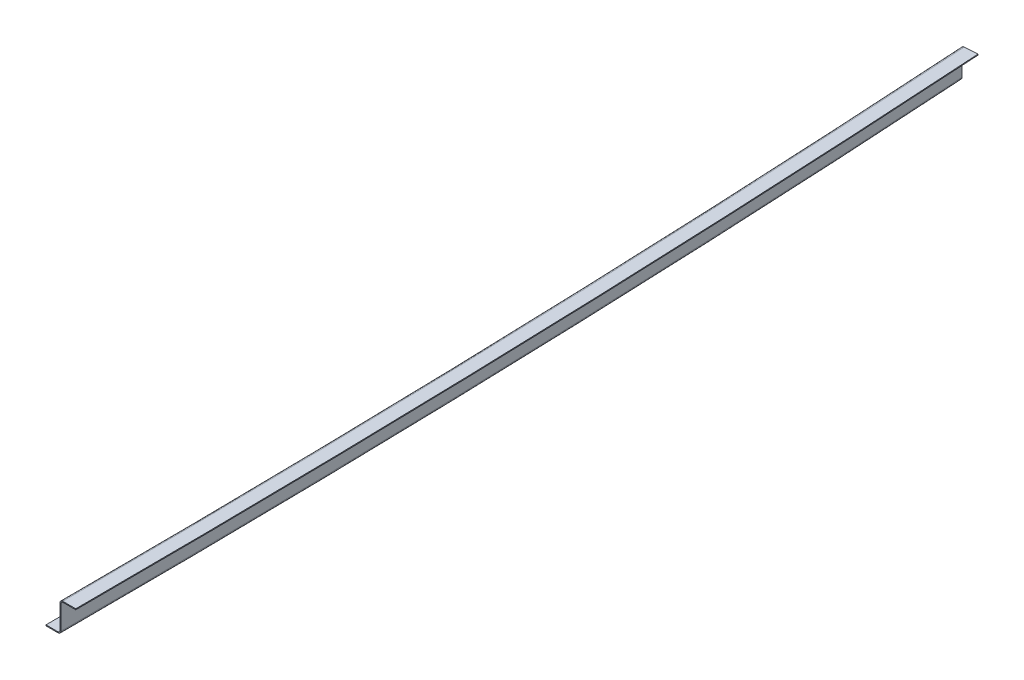
ISO-10303-21;
HEADER;
FILE_DESCRIPTION(('STEP AP214'),'2;1');
FILE_NAME('part.step','',(''),(''),'','','');
FILE_SCHEMA(('AUTOMOTIVE_DESIGN { 1 0 10303 214 1 1 1 1 }'));
ENDSEC;
DATA;
#1=APPLICATION_CONTEXT('core data for automotive mechanical design processes');
#2=APPLICATION_PROTOCOL_DEFINITION('international standard','automotive_design',2000,#1);
#3=PRODUCT_CONTEXT('',#1,'mechanical');
#4=PRODUCT('Part','Part','',(#3));
#5=PRODUCT_RELATED_PRODUCT_CATEGORY('part','',(#4));
#6=PRODUCT_DEFINITION_FORMATION('','',#4);
#7=PRODUCT_DEFINITION_CONTEXT('part definition',#1,'design');
#8=PRODUCT_DEFINITION('design','',#6,#7);
#9=PRODUCT_DEFINITION_SHAPE('','',#8);
#10=(LENGTH_UNIT() NAMED_UNIT(*) SI_UNIT(.MILLI.,.METRE.));
#11=(NAMED_UNIT(*) PLANE_ANGLE_UNIT() SI_UNIT($,.RADIAN.));
#12=(NAMED_UNIT(*) SI_UNIT($,.STERADIAN.) SOLID_ANGLE_UNIT());
#13=UNCERTAINTY_MEASURE_WITH_UNIT(LENGTH_MEASURE(1.E-05),#10,'distance_accuracy_value','');
#14=(GEOMETRIC_REPRESENTATION_CONTEXT(3) GLOBAL_UNCERTAINTY_ASSIGNED_CONTEXT((#13)) GLOBAL_UNIT_ASSIGNED_CONTEXT((#10,
#11,#12)) REPRESENTATION_CONTEXT('',''));
#15=CARTESIAN_POINT('',(0.,0.,0.));
#16=DIRECTION('',(0.,0.,1.));
#17=DIRECTION('',(1.,0.,0.));
#18=AXIS2_PLACEMENT_3D('',#15,#16,#17);
#19=CARTESIAN_POINT('',(-29.3827632036244,29.,-1000.12539184953));
#20=DIRECTION('',(-0.0626959247648903,0.,-0.998032675325751));
#21=DIRECTION('',(-0.998032675325751,0.,0.0626959247648903));
#22=AXIS2_PLACEMENT_3D('',#19,#20,#21);
#23=PLANE('',#22);
#24=DIRECTION('',(0.,1.,0.));
#25=VECTOR('',#24,1.);
#26=CARTESIAN_POINT('',(-29.3827632036248,31.,-1000.12539184953));
#27=LINE('',#26,#25);
#28=CARTESIAN_POINT('',(-29.3827632036248,31.,-1000.12539184953));
#29=VERTEX_POINT('',#28);
#30=CARTESIAN_POINT('',(-29.3827632036248,32.,-1000.12539184953));
#31=VERTEX_POINT('',#30);
#32=EDGE_CURVE('E11',#29,#31,#27,.T.);
#33=ORIENTED_EDGE('',*,*,#32,.F.);
#34=CARTESIAN_POINT('',(-29.3827632036244,29.,-1000.12539184953));
#35=DIRECTION('',(0.0626959247648903,0.,0.998032675325751));
#36=DIRECTION('',(0.998032675325751,0.,-0.0626959247648903));
#37=AXIS2_PLACEMENT_3D('',#34,#35,#36);
#38=CIRCLE('',#37,2.);
#39=CARTESIAN_POINT('',(-31.378828554276,29.,-1000.));
#40=VERTEX_POINT('',#39);
#41=EDGE_CURVE('E156',#40,#29,#38,.F.);
#42=ORIENTED_EDGE('',*,*,#41,.F.);
#43=DIRECTION('',(-0.998032675325751,0.,0.0626959247648904));
#44=VECTOR('',#43,1.);
#45=CARTESIAN_POINT('',(-31.378828554276,29.,-1000.));
#46=LINE('',#45,#44);
#47=CARTESIAN_POINT('',(-32.3768612296025,29.,-999.937304075236));
#48=VERTEX_POINT('',#47);
#49=EDGE_CURVE('E45',#40,#48,#46,.T.);
#50=ORIENTED_EDGE('',*,*,#49,.T.);
#51=CARTESIAN_POINT('',(-29.3827632036248,29.,-1000.12539184953));
#52=DIRECTION('',(0.0626959247648905,0.,0.998032675325751));
#53=DIRECTION('',(0.998032675325751,0.,-0.0626959247648905));
#54=AXIS2_PLACEMENT_3D('',#51,#52,#53);
#55=CIRCLE('',#54,3.);
#56=EDGE_CURVE('E153',#48,#31,#55,.F.);
#57=ORIENTED_EDGE('',*,*,#56,.T.);
#58=EDGE_LOOP('',(#33,#42,#50,#57));
#59=FACE_BOUND('',#58,.T.);
#60=ADVANCED_FACE('F35',(#59),#23,.T.);
#61=CARTESIAN_POINT('',(-31.3788285542759,16.,-1000.));
#62=DIRECTION('',(-0.0626959247648904,0.,-0.998032675325751));
#63=DIRECTION('',(0.,1.,0.));
#64=AXIS2_PLACEMENT_3D('',#61,#62,#63);
#65=PLANE('',#64);
#66=ORIENTED_EDGE('',*,*,#49,.F.);
#67=DIRECTION('',(0.,1.,0.));
#68=VECTOR('',#67,1.);
#69=CARTESIAN_POINT('',(-31.3788285542759,0.,-1000.));
#70=LINE('',#69,#68);
#71=CARTESIAN_POINT('',(-31.378828554276,3.,-1000.));
#72=VERTEX_POINT('',#71);
#73=EDGE_CURVE('E232',#72,#40,#70,.T.);
#74=ORIENTED_EDGE('',*,*,#73,.F.);
#75=DIRECTION('',(-0.998032675325751,0.,0.062695924764886));
#76=VECTOR('',#75,1.);
#77=CARTESIAN_POINT('',(-31.378828554276,3.,-1000.));
#78=LINE('',#77,#76);
#79=CARTESIAN_POINT('',(-32.3768612296025,3.,-999.937304075236));
#80=VERTEX_POINT('',#79);
#81=EDGE_CURVE('E145',#72,#80,#78,.T.);
#82=ORIENTED_EDGE('',*,*,#81,.T.);
#83=DIRECTION('',(0.,1.,0.));
#84=VECTOR('',#83,1.);
#85=CARTESIAN_POINT('',(-32.3768612296025,0.,-999.937304075236));
#86=LINE('',#85,#84);
#87=EDGE_CURVE('E173',#80,#48,#86,.T.);
#88=ORIENTED_EDGE('',*,*,#87,.T.);
#89=EDGE_LOOP('',(#66,#74,#82,#88));
#90=FACE_BOUND('',#89,.T.);
#91=ADVANCED_FACE('F174',(#90),#65,.T.);
#92=CARTESIAN_POINT('',(-34.3729265802532,3.,-999.811912225706));
#93=DIRECTION('',(0.0626959247648903,0.,0.998032675325751));
#94=DIRECTION('',(0.998032675325751,0.,-0.0626959247648903));
#95=AXIS2_PLACEMENT_3D('',#92,#93,#94);
#96=PLANE('',#95);
#97=ORIENTED_EDGE('',*,*,#81,.F.);
#98=CARTESIAN_POINT('',(-34.3729265802532,3.,-999.811912225706));
#99=DIRECTION('',(-0.0626959247648903,0.,-0.998032675325751));
#100=DIRECTION('',(-0.998032675325751,0.,0.0626959247648903));
#101=AXIS2_PLACEMENT_3D('',#98,#99,#100);
#102=CIRCLE('',#101,3.);
#103=CARTESIAN_POINT('',(-34.3729265802537,0.,-999.811912225706));
#104=VERTEX_POINT('',#103);
#105=EDGE_CURVE('E221',#104,#72,#102,.F.);
#106=ORIENTED_EDGE('',*,*,#105,.F.);
#107=DIRECTION('',(0.,1.,0.));
#108=VECTOR('',#107,1.);
#109=CARTESIAN_POINT('',(-34.3729265802537,0.,-999.811912225706));
#110=LINE('',#109,#108);
#111=CARTESIAN_POINT('',(-34.3729265802519,1.,-999.811912225706));
#112=VERTEX_POINT('',#111);
#113=EDGE_CURVE('E142',#104,#112,#110,.T.);
#114=ORIENTED_EDGE('',*,*,#113,.T.);
#115=CARTESIAN_POINT('',(-34.3729265802537,3.,-999.811912225706));
#116=DIRECTION('',(0.0626959247648905,0.,0.998032675325751));
#117=DIRECTION('',(0.998032675325751,0.,-0.0626959247648905));
#118=AXIS2_PLACEMENT_3D('',#115,#116,#117);
#119=CIRCLE('',#118,2.);
#120=EDGE_CURVE('E190',#112,#80,#119,.T.);
#121=ORIENTED_EDGE('',*,*,#120,.T.);
#122=EDGE_LOOP('',(#97,#106,#114,#121));
#123=FACE_BOUND('',#122,.T.);
#124=ADVANCED_FACE('F264',(#123),#96,.F.);
#125=CARTESIAN_POINT('',(-31.3788285542759,0.,-1000.));
#126=DIRECTION('',(0.0626959247648903,0.,0.998032675325751));
#127=DIRECTION('',(0.998032675325751,0.,-0.0626959247648903));
#128=AXIS2_PLACEMENT_3D('',#125,#126,#127);
#129=PLANE('',#128);
#130=ORIENTED_EDGE('',*,*,#113,.F.);
#131=DIRECTION('',(0.998032675325751,0.,-0.0626959247648903));
#132=VECTOR('',#131,1.);
#133=CARTESIAN_POINT('',(-31.3788285542759,0.,-1000.));
#134=LINE('',#133,#132);
#135=CARTESIAN_POINT('',(-47.3473513594893,0.,-998.996865203762));
#136=VERTEX_POINT('',#135);
#137=EDGE_CURVE('E215',#136,#104,#134,.T.);
#138=ORIENTED_EDGE('',*,*,#137,.F.);
#139=DIRECTION('',(0.,1.,0.));
#140=VECTOR('',#139,1.);
#141=CARTESIAN_POINT('',(-47.3473513594893,0.,-998.996865203762));
#142=LINE('',#141,#140);
#143=CARTESIAN_POINT('',(-47.3473513594893,0.999999999999999,-998.996865203762));
#144=VERTEX_POINT('',#143);
#145=EDGE_CURVE('E139',#136,#144,#142,.T.);
#146=ORIENTED_EDGE('',*,*,#145,.T.);
#147=DIRECTION('',(0.998032675325751,0.,-0.0626959247648903));
#148=VECTOR('',#147,1.);
#149=CARTESIAN_POINT('',(-31.3788285542759,1.,-1000.));
#150=LINE('',#149,#148);
#151=EDGE_CURVE('E194',#144,#112,#150,.T.);
#152=ORIENTED_EDGE('',*,*,#151,.T.);
#153=EDGE_LOOP('',(#130,#138,#146,#152));
#154=FACE_BOUND('',#153,.T.);
#155=ADVANCED_FACE('F271',(#154),#129,.F.);
#156=CARTESIAN_POINT('',(-15950.,0.,1.95331164464003E-12));
#157=DIRECTION('',(0.,1.,0.));
#158=DIRECTION('',(0.,0.,1.));
#159=AXIS2_PLACEMENT_3D('',#156,#157,#158);
#160=CYLINDRICAL_SURFACE('',#159,15934.);
#161=ORIENTED_EDGE('',*,*,#145,.F.);
#162=CARTESIAN_POINT('',(-15950.,0.,1.95331164464003E-12));
#163=DIRECTION('',(0.,1.,0.));
#164=DIRECTION('',(1.,0.,0.));
#165=AXIS2_PLACEMENT_3D('',#162,#163,#164);
#166=CIRCLE('',#165,15934.);
#167=CARTESIAN_POINT('',(-16.,0.,0.));
#168=VERTEX_POINT('',#167);
#169=EDGE_CURVE('E111',#168,#136,#166,.T.);
#170=ORIENTED_EDGE('',*,*,#169,.F.);
#171=DIRECTION('',(0.,1.,0.));
#172=VECTOR('',#171,1.);
#173=CARTESIAN_POINT('',(-16.,0.,0.));
#174=LINE('',#173,#172);
#175=CARTESIAN_POINT('',(-16.,0.999999999999999,0.));
#176=VERTEX_POINT('',#175);
#177=EDGE_CURVE('E136',#168,#176,#174,.T.);
#178=ORIENTED_EDGE('',*,*,#177,.T.);
#179=CARTESIAN_POINT('',(-15950.,0.999999999999998,1.95331164464003E-12));
#180=DIRECTION('',(0.,1.,0.));
#181=DIRECTION('',(0.,0.,1.));
#182=AXIS2_PLACEMENT_3D('',#179,#180,#181);
#183=CIRCLE('',#182,15934.);
#184=EDGE_CURVE('E199',#176,#144,#183,.T.);
#185=ORIENTED_EDGE('',*,*,#184,.T.);
#186=EDGE_LOOP('',(#161,#170,#178,#185));
#187=FACE_BOUND('',#186,.T.);
#188=ADVANCED_FACE('F296',(#187),#160,.F.);
#189=CARTESIAN_POINT('',(0.,0.,0.));
#190=DIRECTION('',(0.,0.,1.));
#191=DIRECTION('',(1.,0.,0.));
#192=AXIS2_PLACEMENT_3D('',#189,#190,#191);
#193=PLANE('',#192);
#194=ORIENTED_EDGE('',*,*,#177,.F.);
#195=DIRECTION('',(1.,0.,0.));
#196=VECTOR('',#195,1.);
#197=CARTESIAN_POINT('',(0.,0.,0.));
#198=LINE('',#197,#196);
#199=CARTESIAN_POINT('',(-3.00000000000011,0.,0.));
#200=VERTEX_POINT('',#199);
#201=EDGE_CURVE('E211',#168,#200,#198,.T.);
#202=ORIENTED_EDGE('',*,*,#201,.T.);
#203=DIRECTION('',(0.,1.,0.));
#204=VECTOR('',#203,1.);
#205=CARTESIAN_POINT('',(-3.00000000000011,0.,0.));
#206=LINE('',#205,#204);
#207=CARTESIAN_POINT('',(-3.00000000000011,0.999999999999999,0.));
#208=VERTEX_POINT('',#207);
#209=EDGE_CURVE('E133',#200,#208,#206,.T.);
#210=ORIENTED_EDGE('',*,*,#209,.T.);
#211=DIRECTION('',(1.,0.,0.));
#212=VECTOR('',#211,1.);
#213=CARTESIAN_POINT('',(0.,0.999999999999999,0.));
#214=LINE('',#213,#212);
#215=EDGE_CURVE('E118',#176,#208,#214,.T.);
#216=ORIENTED_EDGE('',*,*,#215,.F.);
#217=EDGE_LOOP('',(#194,#202,#210,#216));
#218=FACE_BOUND('',#217,.T.);
#219=ADVANCED_FACE('F298',(#218),#193,.T.);
#220=CARTESIAN_POINT('',(-3.,3.,0.));
#221=DIRECTION('',(0.,0.,1.));
#222=DIRECTION('',(1.,0.,0.));
#223=AXIS2_PLACEMENT_3D('',#220,#221,#222);
#224=PLANE('',#223);
#225=ORIENTED_EDGE('',*,*,#209,.F.);
#226=CARTESIAN_POINT('',(-3.,3.,0.));
#227=DIRECTION('',(0.,0.,-1.));
#228=DIRECTION('',(-1.,0.,0.));
#229=AXIS2_PLACEMENT_3D('',#226,#227,#228);
#230=CIRCLE('',#229,3.);
#231=CARTESIAN_POINT('',(0.,3.,0.));
#232=VERTEX_POINT('',#231);
#233=EDGE_CURVE('E214',#200,#232,#230,.F.);
#234=ORIENTED_EDGE('',*,*,#233,.T.);
#235=DIRECTION('',(-1.,0.,0.));
#236=VECTOR('',#235,1.);
#237=CARTESIAN_POINT('',(0.,3.,0.));
#238=LINE('',#237,#236);
#239=CARTESIAN_POINT('',(-0.999999999999446,3.,-6.11483169329239E-13));
#240=VERTEX_POINT('',#239);
#241=EDGE_CURVE('E130',#232,#240,#238,.T.);
#242=ORIENTED_EDGE('',*,*,#241,.T.);
#243=CARTESIAN_POINT('',(-3.00000000000011,3.,-6.11161544799304E-13));
#244=DIRECTION('',(0.,0.,1.));
#245=DIRECTION('',(1.,0.,0.));
#246=AXIS2_PLACEMENT_3D('',#243,#244,#245);
#247=CIRCLE('',#246,2.);
#248=EDGE_CURVE('E121',#208,#240,#247,.T.);
#249=ORIENTED_EDGE('',*,*,#248,.F.);
#250=EDGE_LOOP('',(#225,#234,#242,#249));
#251=FACE_BOUND('',#250,.T.);
#252=ADVANCED_FACE('F278',(#251),#224,.T.);
#253=CARTESIAN_POINT('',(0.,16.,0.));
#254=DIRECTION('',(0.,0.,-1.));
#255=DIRECTION('',(0.,1.,0.));
#256=AXIS2_PLACEMENT_3D('',#253,#254,#255);
#257=PLANE('',#256);
#258=ORIENTED_EDGE('',*,*,#241,.F.);
#259=DIRECTION('',(0.,1.,0.));
#260=VECTOR('',#259,1.);
#261=CARTESIAN_POINT('',(0.,0.,0.));
#262=LINE('',#261,#260);
#263=CARTESIAN_POINT('',(0.,29.,0.));
#264=VERTEX_POINT('',#263);
#265=EDGE_CURVE('E226',#232,#264,#262,.T.);
#266=ORIENTED_EDGE('',*,*,#265,.T.);
#267=DIRECTION('',(-1.,0.,0.));
#268=VECTOR('',#267,1.);
#269=CARTESIAN_POINT('',(0.,29.,0.));
#270=LINE('',#269,#268);
#271=CARTESIAN_POINT('',(-0.999999999999446,29.,-6.11483169329239E-13));
#272=VERTEX_POINT('',#271);
#273=EDGE_CURVE('E127',#264,#272,#270,.T.);
#274=ORIENTED_EDGE('',*,*,#273,.T.);
#275=DIRECTION('',(0.,1.,0.));
#276=VECTOR('',#275,1.);
#277=CARTESIAN_POINT('',(-0.999999999999446,0.,-6.11483169329239E-13));
#278=LINE('',#277,#276);
#279=EDGE_CURVE('E183',#240,#272,#278,.T.);
#280=ORIENTED_EDGE('',*,*,#279,.F.);
#281=EDGE_LOOP('',(#258,#266,#274,#280));
#282=FACE_BOUND('',#281,.T.);
#283=ADVANCED_FACE('F281',(#282),#257,.F.);
#284=CARTESIAN_POINT('',(2.,29.,0.));
#285=DIRECTION('',(0.,0.,-1.));
#286=DIRECTION('',(-1.,0.,0.));
#287=AXIS2_PLACEMENT_3D('',#284,#285,#286);
#288=PLANE('',#287);
#289=ORIENTED_EDGE('',*,*,#273,.F.);
#290=CARTESIAN_POINT('',(2.,29.,0.));
#291=DIRECTION('',(0.,0.,1.));
#292=DIRECTION('',(1.,0.,0.));
#293=AXIS2_PLACEMENT_3D('',#290,#291,#292);
#294=CIRCLE('',#293,2.);
#295=CARTESIAN_POINT('',(2.00000000000067,31.,0.));
#296=VERTEX_POINT('',#295);
#297=EDGE_CURVE('E112',#264,#296,#294,.F.);
#298=ORIENTED_EDGE('',*,*,#297,.T.);
#299=DIRECTION('',(0.,1.,0.));
#300=VECTOR('',#299,1.);
#301=CARTESIAN_POINT('',(2.00000000000067,31.,0.));
#302=LINE('',#301,#300);
#303=CARTESIAN_POINT('',(2.00000000000067,32.,-6.11965606124142E-13));
#304=VERTEX_POINT('',#303);
#305=EDGE_CURVE('E101',#296,#304,#302,.T.);
#306=ORIENTED_EDGE('',*,*,#305,.T.);
#307=CARTESIAN_POINT('',(2.00000000000067,29.,-6.11965606124142E-13));
#308=DIRECTION('',(0.,0.,1.));
#309=DIRECTION('',(1.,0.,0.));
#310=AXIS2_PLACEMENT_3D('',#307,#308,#309);
#311=CIRCLE('',#310,3.);
#312=EDGE_CURVE('E200',#272,#304,#311,.F.);
#313=ORIENTED_EDGE('',*,*,#312,.F.);
#314=EDGE_LOOP('',(#289,#298,#306,#313));
#315=FACE_BOUND('',#314,.T.);
#316=ADVANCED_FACE('F287',(#315),#288,.F.);
#317=CARTESIAN_POINT('',(0.,31.,0.));
#318=DIRECTION('',(0.,0.,1.));
#319=DIRECTION('',(1.,0.,0.));
#320=AXIS2_PLACEMENT_3D('',#317,#318,#319);
#321=PLANE('',#320);
#322=ORIENTED_EDGE('',*,*,#305,.F.);
#323=DIRECTION('',(1.,0.,0.));
#324=VECTOR('',#323,1.);
#325=CARTESIAN_POINT('',(0.,31.,0.));
#326=LINE('',#325,#324);
#327=CARTESIAN_POINT('',(16.,31.,0.));
#328=VERTEX_POINT('',#327);
#329=EDGE_CURVE('E104',#296,#328,#326,.T.);
#330=ORIENTED_EDGE('',*,*,#329,.T.);
#331=DIRECTION('',(0.,1.,0.));
#332=VECTOR('',#331,1.);
#333=CARTESIAN_POINT('',(16.,31.,0.));
#334=LINE('',#333,#332);
#335=CARTESIAN_POINT('',(16.,32.,0.));
#336=VERTEX_POINT('',#335);
#337=EDGE_CURVE('E90',#328,#336,#334,.T.);
#338=ORIENTED_EDGE('',*,*,#337,.T.);
#339=DIRECTION('',(1.,0.,0.));
#340=VECTOR('',#339,1.);
#341=CARTESIAN_POINT('',(0.,32.,0.));
#342=LINE('',#341,#340);
#343=EDGE_CURVE('E197',#304,#336,#342,.T.);
#344=ORIENTED_EDGE('',*,*,#343,.F.);
#345=EDGE_LOOP('',(#322,#330,#338,#344));
#346=FACE_BOUND('',#345,.T.);
#347=ADVANCED_FACE('F105',(#346),#321,.T.);
#348=CARTESIAN_POINT('',(-15950.,31.,1.95331164464003E-12));
#349=DIRECTION('',(0.,1.,0.));
#350=DIRECTION('',(0.,0.,1.));
#351=AXIS2_PLACEMENT_3D('',#348,#349,#350);
#352=CYLINDRICAL_SURFACE('',#351,15966.);
#353=ORIENTED_EDGE('',*,*,#337,.F.);
#354=CARTESIAN_POINT('',(-15950.,31.,1.95331164464003E-12));
#355=DIRECTION('',(0.,1.,0.));
#356=DIRECTION('',(1.,0.,0.));
#357=AXIS2_PLACEMENT_3D('',#354,#355,#356);
#358=CIRCLE('',#357,15966.);
#359=CARTESIAN_POINT('',(-15.4103057490644,31.,-1001.00313479624));
#360=VERTEX_POINT('',#359);
#361=EDGE_CURVE('E94',#328,#360,#358,.T.);
#362=ORIENTED_EDGE('',*,*,#361,.T.);
#363=DIRECTION('',(0.,1.,0.));
#364=VECTOR('',#363,1.);
#365=CARTESIAN_POINT('',(-15.4103057490644,31.,-1001.00313479624));
#366=LINE('',#365,#364);
#367=CARTESIAN_POINT('',(-15.4103057490644,32.,-1001.00313479624));
#368=VERTEX_POINT('',#367);
#369=EDGE_CURVE('E39',#360,#368,#366,.T.);
#370=ORIENTED_EDGE('',*,*,#369,.T.);
#371=CARTESIAN_POINT('',(-15950.,32.,1.95331164464003E-12));
#372=DIRECTION('',(0.,1.,0.));
#373=DIRECTION('',(0.,0.,1.));
#374=AXIS2_PLACEMENT_3D('',#371,#372,#373);
#375=CIRCLE('',#374,15966.);
#376=EDGE_CURVE('E97',#336,#368,#375,.T.);
#377=ORIENTED_EDGE('',*,*,#376,.F.);
#378=EDGE_LOOP('',(#353,#362,#370,#377));
#379=FACE_BOUND('',#378,.T.);
#380=ADVANCED_FACE('F92',(#379),#352,.T.);
#381=CARTESIAN_POINT('',(-31.3788285542759,31.,-1000.));
#382=DIRECTION('',(0.0626959247648903,0.,0.998032675325751));
#383=DIRECTION('',(0.998032675325751,0.,-0.0626959247648903));
#384=AXIS2_PLACEMENT_3D('',#381,#382,#383);
#385=PLANE('',#384);
#386=DIRECTION('',(0.998032675325751,0.,-0.0626959247648903));
#387=VECTOR('',#386,1.);
#388=CARTESIAN_POINT('',(-31.3788285542759,31.,-1000.));
#389=LINE('',#388,#387);
#390=EDGE_CURVE('E117',#29,#360,#389,.T.);
#391=ORIENTED_EDGE('',*,*,#390,.F.);
#392=ORIENTED_EDGE('',*,*,#32,.T.);
#393=DIRECTION('',(0.998032675325751,0.,-0.0626959247648903));
#394=VECTOR('',#393,1.);
#395=CARTESIAN_POINT('',(-31.3788285542759,32.,-1000.));
#396=LINE('',#395,#394);
#397=EDGE_CURVE('E196',#31,#368,#396,.T.);
#398=ORIENTED_EDGE('',*,*,#397,.T.);
#399=ORIENTED_EDGE('',*,*,#369,.F.);
#400=EDGE_LOOP('',(#391,#392,#398,#399));
#401=FACE_BOUND('',#400,.T.);
#402=ADVANCED_FACE('F37',(#401),#385,.F.);
#403=CARTESIAN_POINT('',(0.,32.,0.));
#404=DIRECTION('',(0.,1.,0.));
#405=DIRECTION('',(0.,0.,1.));
#406=AXIS2_PLACEMENT_3D('',#403,#404,#405);
#407=PLANE('',#406);
#408=ORIENTED_EDGE('',*,*,#376,.T.);
#409=ORIENTED_EDGE('',*,*,#397,.F.);
#410=CARTESIAN_POINT('',(-15950.,32.,1.95331164464003E-12));
#411=DIRECTION('',(0.,1.,0.));
#412=DIRECTION('',(0.,0.,1.));
#413=AXIS2_PLACEMENT_3D('',#410,#411,#412);
#414=CIRCLE('',#413,15952.);
#415=EDGE_CURVE('E170',#304,#31,#414,.T.);
#416=ORIENTED_EDGE('',*,*,#415,.F.);
#417=ORIENTED_EDGE('',*,*,#343,.T.);
#418=EDGE_LOOP('',(#408,#409,#416,#417));
#419=FACE_BOUND('',#418,.T.);
#420=ADVANCED_FACE('F388',(#419),#407,.T.);
#421=CARTESIAN_POINT('',(-15950.,29.,1.95331164464003E-12));
#422=DIRECTION('',(0.,1.,0.));
#423=DIRECTION('',(0.,0.,1.));
#424=AXIS2_PLACEMENT_3D('',#421,#422,#423);
#425=TOROIDAL_SURFACE('',#424,15952.,3.);
#426=ORIENTED_EDGE('',*,*,#415,.T.);
#427=ORIENTED_EDGE('',*,*,#56,.F.);
#428=CARTESIAN_POINT('',(-15950.,29.,1.95331164464003E-12));
#429=DIRECTION('',(0.,1.,0.));
#430=DIRECTION('',(0.,0.,1.));
#431=AXIS2_PLACEMENT_3D('',#428,#429,#430);
#432=CIRCLE('',#431,15949.);
#433=EDGE_CURVE('E168',#272,#48,#432,.T.);
#434=ORIENTED_EDGE('',*,*,#433,.F.);
#435=ORIENTED_EDGE('',*,*,#312,.T.);
#436=EDGE_LOOP('',(#426,#427,#434,#435));
#437=FACE_BOUND('',#436,.T.);
#438=ADVANCED_FACE('F164',(#437),#425,.T.);
#439=CARTESIAN_POINT('',(-15950.,0.,1.95331164464003E-12));
#440=DIRECTION('',(0.,1.,0.));
#441=DIRECTION('',(0.,0.,1.));
#442=AXIS2_PLACEMENT_3D('',#439,#440,#441);
#443=CYLINDRICAL_SURFACE('',#442,15949.);
#444=ORIENTED_EDGE('',*,*,#433,.T.);
#445=ORIENTED_EDGE('',*,*,#87,.F.);
#446=CARTESIAN_POINT('',(-15950.,3.,1.95331164464003E-12));
#447=DIRECTION('',(0.,1.,0.));
#448=DIRECTION('',(0.,0.,1.));
#449=AXIS2_PLACEMENT_3D('',#446,#447,#448);
#450=CIRCLE('',#449,15949.);
#451=EDGE_CURVE('E178',#240,#80,#450,.T.);
#452=ORIENTED_EDGE('',*,*,#451,.F.);
#453=ORIENTED_EDGE('',*,*,#279,.T.);
#454=EDGE_LOOP('',(#444,#445,#452,#453));
#455=FACE_BOUND('',#454,.T.);
#456=ADVANCED_FACE('F181',(#455),#443,.F.);
#457=CARTESIAN_POINT('',(-15950.,3.,1.95331164464003E-12));
#458=DIRECTION('',(0.,1.,0.));
#459=DIRECTION('',(0.,0.,1.));
#460=AXIS2_PLACEMENT_3D('',#457,#458,#459);
#461=TOROIDAL_SURFACE('',#460,15947.,2.);
#462=ORIENTED_EDGE('',*,*,#451,.T.);
#463=ORIENTED_EDGE('',*,*,#120,.F.);
#464=CARTESIAN_POINT('',(-15950.,1.,1.95331164464003E-12));
#465=DIRECTION('',(0.,1.,0.));
#466=DIRECTION('',(0.,0.,1.));
#467=AXIS2_PLACEMENT_3D('',#464,#465,#466);
#468=CIRCLE('',#467,15947.);
#469=EDGE_CURVE('E191',#208,#112,#468,.T.);
#470=ORIENTED_EDGE('',*,*,#469,.F.);
#471=ORIENTED_EDGE('',*,*,#248,.T.);
#472=EDGE_LOOP('',(#462,#463,#470,#471));
#473=FACE_BOUND('',#472,.T.);
#474=ADVANCED_FACE('F269',(#473),#461,.F.);
#475=CARTESIAN_POINT('',(0.,0.999999999999999,0.));
#476=DIRECTION('',(0.,1.,0.));
#477=DIRECTION('',(0.,0.,1.));
#478=AXIS2_PLACEMENT_3D('',#475,#476,#477);
#479=PLANE('',#478);
#480=ORIENTED_EDGE('',*,*,#469,.T.);
#481=ORIENTED_EDGE('',*,*,#151,.F.);
#482=ORIENTED_EDGE('',*,*,#184,.F.);
#483=ORIENTED_EDGE('',*,*,#215,.T.);
#484=EDGE_LOOP('',(#480,#481,#482,#483));
#485=FACE_BOUND('',#484,.T.);
#486=ADVANCED_FACE('F273',(#485),#479,.T.);
#487=CARTESIAN_POINT('',(0.,31.,0.));
#488=DIRECTION('',(0.,1.,0.));
#489=DIRECTION('',(0.,0.,1.));
#490=AXIS2_PLACEMENT_3D('',#487,#488,#489);
#491=PLANE('',#490);
#492=ORIENTED_EDGE('',*,*,#361,.F.);
#493=ORIENTED_EDGE('',*,*,#329,.F.);
#494=CARTESIAN_POINT('',(-15950.,31.,1.95331164464003E-12));
#495=DIRECTION('',(0.,1.,0.));
#496=DIRECTION('',(1.,0.,0.));
#497=AXIS2_PLACEMENT_3D('',#494,#495,#496);
#498=CIRCLE('',#497,15952.);
#499=EDGE_CURVE('E123',#296,#29,#498,.T.);
#500=ORIENTED_EDGE('',*,*,#499,.T.);
#501=ORIENTED_EDGE('',*,*,#390,.T.);
#502=EDGE_LOOP('',(#492,#493,#500,#501));
#503=FACE_BOUND('',#502,.T.);
#504=ADVANCED_FACE('F115',(#503),#491,.F.);
#505=CARTESIAN_POINT('',(-15950.,29.,1.95331164464003E-12));
#506=DIRECTION('',(0.,1.,0.));
#507=DIRECTION('',(0.,0.,1.));
#508=AXIS2_PLACEMENT_3D('',#505,#506,#507);
#509=TOROIDAL_SURFACE('',#508,15952.,2.);
#510=ORIENTED_EDGE('',*,*,#499,.F.);
#511=ORIENTED_EDGE('',*,*,#297,.F.);
#512=CARTESIAN_POINT('',(-15950.,29.,1.95331164464003E-12));
#513=DIRECTION('',(0.,1.,0.));
#514=DIRECTION('',(1.,0.,0.));
#515=AXIS2_PLACEMENT_3D('',#512,#513,#514);
#516=CIRCLE('',#515,15950.);
#517=EDGE_CURVE('E237',#264,#40,#516,.T.);
#518=ORIENTED_EDGE('',*,*,#517,.T.);
#519=ORIENTED_EDGE('',*,*,#41,.T.);
#520=EDGE_LOOP('',(#510,#511,#518,#519));
#521=FACE_BOUND('',#520,.T.);
#522=ADVANCED_FACE('F243',(#521),#509,.F.);
#523=CARTESIAN_POINT('',(-15950.,0.,1.95331164464003E-12));
#524=DIRECTION('',(0.,1.,0.));
#525=DIRECTION('',(0.,0.,1.));
#526=AXIS2_PLACEMENT_3D('',#523,#524,#525);
#527=CYLINDRICAL_SURFACE('',#526,15950.);
#528=ORIENTED_EDGE('',*,*,#517,.F.);
#529=ORIENTED_EDGE('',*,*,#265,.F.);
#530=CARTESIAN_POINT('',(-15950.,3.,1.95331164464003E-12));
#531=DIRECTION('',(0.,1.,0.));
#532=DIRECTION('',(1.,0.,0.));
#533=AXIS2_PLACEMENT_3D('',#530,#531,#532);
#534=CIRCLE('',#533,15950.);
#535=EDGE_CURVE('E229',#232,#72,#534,.T.);
#536=ORIENTED_EDGE('',*,*,#535,.T.);
#537=ORIENTED_EDGE('',*,*,#73,.T.);
#538=EDGE_LOOP('',(#528,#529,#536,#537));
#539=FACE_BOUND('',#538,.T.);
#540=ADVANCED_FACE('F289',(#539),#527,.T.);
#541=CARTESIAN_POINT('',(-15950.,3.,1.95331164464003E-12));
#542=DIRECTION('',(0.,1.,0.));
#543=DIRECTION('',(0.,0.,1.));
#544=AXIS2_PLACEMENT_3D('',#541,#542,#543);
#545=TOROIDAL_SURFACE('',#544,15947.,3.);
#546=ORIENTED_EDGE('',*,*,#535,.F.);
#547=ORIENTED_EDGE('',*,*,#233,.F.);
#548=CARTESIAN_POINT('',(-15950.,0.,1.95331164464003E-12));
#549=DIRECTION('',(0.,1.,0.));
#550=DIRECTION('',(1.,0.,0.));
#551=AXIS2_PLACEMENT_3D('',#548,#549,#550);
#552=CIRCLE('',#551,15947.);
#553=EDGE_CURVE('E218',#200,#104,#552,.T.);
#554=ORIENTED_EDGE('',*,*,#553,.T.);
#555=ORIENTED_EDGE('',*,*,#105,.T.);
#556=EDGE_LOOP('',(#546,#547,#554,#555));
#557=FACE_BOUND('',#556,.T.);
#558=ADVANCED_FACE('F292',(#557),#545,.T.);
#559=CARTESIAN_POINT('',(0.,0.,0.));
#560=DIRECTION('',(0.,1.,0.));
#561=DIRECTION('',(0.,0.,1.));
#562=AXIS2_PLACEMENT_3D('',#559,#560,#561);
#563=PLANE('',#562);
#564=ORIENTED_EDGE('',*,*,#553,.F.);
#565=ORIENTED_EDGE('',*,*,#201,.F.);
#566=ORIENTED_EDGE('',*,*,#169,.T.);
#567=ORIENTED_EDGE('',*,*,#137,.T.);
#568=EDGE_LOOP('',(#564,#565,#566,#567));
#569=FACE_BOUND('',#568,.T.);
#570=ADVANCED_FACE('F295',(#569),#563,.F.);
#571=CLOSED_SHELL('',(#60,#91,#124,#155,#188,#219,#252,#283,#316,#347,#380,#402,#420,#438,#456,
#474,#486,#504,#522,#540,#558,#570));
#572=MANIFOLD_SOLID_BREP('B2',#571);
#573=ADVANCED_BREP_SHAPE_REPRESENTATION('',(#18,#572),#14);
#574=SHAPE_DEFINITION_REPRESENTATION(#9,#573);
ENDSEC;
END-ISO-10303-21;
